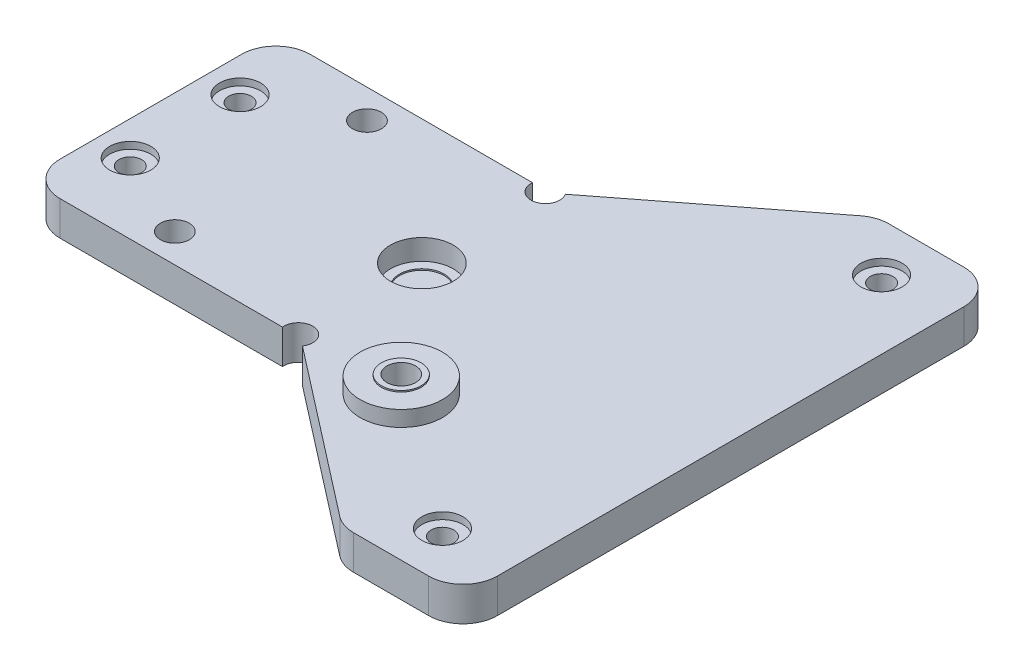
ISO-10303-21;
HEADER;
FILE_DESCRIPTION(('STEP AP214'),'2;1');
FILE_NAME('part.step','',(''),(''),'','','');
FILE_SCHEMA(('AUTOMOTIVE_DESIGN { 1 0 10303 214 1 1 1 1 }'));
ENDSEC;
DATA;
#1=APPLICATION_CONTEXT('core data for automotive mechanical design processes');
#2=APPLICATION_PROTOCOL_DEFINITION('international standard','automotive_design',2000,#1);
#3=PRODUCT_CONTEXT('',#1,'mechanical');
#4=PRODUCT('Part','Part','',(#3));
#5=PRODUCT_RELATED_PRODUCT_CATEGORY('part','',(#4));
#6=PRODUCT_DEFINITION_FORMATION('','',#4);
#7=PRODUCT_DEFINITION_CONTEXT('part definition',#1,'design');
#8=PRODUCT_DEFINITION('design','',#6,#7);
#9=PRODUCT_DEFINITION_SHAPE('','',#8);
#10=(LENGTH_UNIT() NAMED_UNIT(*) SI_UNIT(.MILLI.,.METRE.));
#11=(NAMED_UNIT(*) PLANE_ANGLE_UNIT() SI_UNIT($,.RADIAN.));
#12=(NAMED_UNIT(*) SI_UNIT($,.STERADIAN.) SOLID_ANGLE_UNIT());
#13=UNCERTAINTY_MEASURE_WITH_UNIT(LENGTH_MEASURE(1.E-05),#10,'distance_accuracy_value','');
#14=(GEOMETRIC_REPRESENTATION_CONTEXT(3) GLOBAL_UNCERTAINTY_ASSIGNED_CONTEXT((#13)) GLOBAL_UNIT_ASSIGNED_CONTEXT((#10,
#11,#12)) REPRESENTATION_CONTEXT('',''));
#15=CARTESIAN_POINT('',(0.,0.,0.));
#16=DIRECTION('',(0.,0.,1.));
#17=DIRECTION('',(1.,0.,0.));
#18=AXIS2_PLACEMENT_3D('',#15,#16,#17);
#19=CARTESIAN_POINT('',(-34.5,0.,-8.));
#20=DIRECTION('',(0.,1.,0.));
#21=DIRECTION('',(0.,0.,1.));
#22=AXIS2_PLACEMENT_3D('',#19,#20,#21);
#23=CYLINDRICAL_SURFACE('',#22,1.65);
#24=CARTESIAN_POINT('',(-34.5,0.,-8.));
#25=DIRECTION('',(0.,1.,0.));
#26=DIRECTION('',(0.,0.,1.));
#27=AXIS2_PLACEMENT_3D('',#24,#25,#26);
#28=CIRCLE('',#27,1.65);
#29=CARTESIAN_POINT('',(-34.5,0.,-6.35));
#30=VERTEX_POINT('',#29);
#31=EDGE_CURVE('E277',#30,#30,#28,.T.);
#32=ORIENTED_EDGE('',*,*,#31,.F.);
#33=EDGE_LOOP('',(#32));
#34=FACE_BOUND('',#33,.T.);
#35=CARTESIAN_POINT('',(-34.5,4.,-8.));
#36=DIRECTION('',(0.,1.,0.));
#37=DIRECTION('',(0.,0.,1.));
#38=AXIS2_PLACEMENT_3D('',#35,#36,#37);
#39=CIRCLE('',#38,1.65);
#40=CARTESIAN_POINT('',(-34.5,4.,-6.35));
#41=VERTEX_POINT('',#40);
#42=EDGE_CURVE('E109',#41,#41,#39,.F.);
#43=ORIENTED_EDGE('',*,*,#42,.F.);
#44=EDGE_LOOP('',(#43));
#45=FACE_BOUND('',#44,.T.);
#46=ADVANCED_FACE('F105',(#34,#45),#23,.F.);
#47=CARTESIAN_POINT('',(-34.5,0.,8.));
#48=DIRECTION('',(0.,1.,0.));
#49=DIRECTION('',(0.,0.,1.));
#50=AXIS2_PLACEMENT_3D('',#47,#48,#49);
#51=CYLINDRICAL_SURFACE('',#50,1.65);
#52=CARTESIAN_POINT('',(-34.5,0.,8.));
#53=DIRECTION('',(0.,1.,0.));
#54=DIRECTION('',(0.,0.,1.));
#55=AXIS2_PLACEMENT_3D('',#52,#53,#54);
#56=CIRCLE('',#55,1.65);
#57=CARTESIAN_POINT('',(-34.5,0.,9.65));
#58=VERTEX_POINT('',#57);
#59=EDGE_CURVE('E281',#58,#58,#56,.T.);
#60=ORIENTED_EDGE('',*,*,#59,.F.);
#61=EDGE_LOOP('',(#60));
#62=FACE_BOUND('',#61,.T.);
#63=CARTESIAN_POINT('',(-34.5,4.,8.));
#64=DIRECTION('',(0.,1.,0.));
#65=DIRECTION('',(0.,0.,1.));
#66=AXIS2_PLACEMENT_3D('',#63,#64,#65);
#67=CIRCLE('',#66,1.65);
#68=CARTESIAN_POINT('',(-34.5,4.,9.65));
#69=VERTEX_POINT('',#68);
#70=EDGE_CURVE('E377',#69,#69,#67,.F.);
#71=ORIENTED_EDGE('',*,*,#70,.F.);
#72=EDGE_LOOP('',(#71));
#73=FACE_BOUND('',#72,.T.);
#74=ADVANCED_FACE('F486',(#62,#73),#51,.F.);
#75=CARTESIAN_POINT('',(35.,0.,32.));
#76=DIRECTION('',(0.,1.,0.));
#77=DIRECTION('',(0.,0.,1.));
#78=AXIS2_PLACEMENT_3D('',#75,#76,#77);
#79=CYLINDRICAL_SURFACE('',#78,1.65);
#80=CARTESIAN_POINT('',(35.,0.,32.));
#81=DIRECTION('',(0.,1.,0.));
#82=DIRECTION('',(0.,0.,1.));
#83=AXIS2_PLACEMENT_3D('',#80,#81,#82);
#84=CIRCLE('',#83,1.65);
#85=CARTESIAN_POINT('',(35.,0.,33.65));
#86=VERTEX_POINT('',#85);
#87=EDGE_CURVE('E402',#86,#86,#84,.T.);
#88=ORIENTED_EDGE('',*,*,#87,.F.);
#89=EDGE_LOOP('',(#88));
#90=FACE_BOUND('',#89,.T.);
#91=CARTESIAN_POINT('',(35.,4.,32.));
#92=DIRECTION('',(0.,1.,0.));
#93=DIRECTION('',(0.,0.,1.));
#94=AXIS2_PLACEMENT_3D('',#91,#92,#93);
#95=CIRCLE('',#94,1.65);
#96=CARTESIAN_POINT('',(35.,4.,33.65));
#97=VERTEX_POINT('',#96);
#98=EDGE_CURVE('E374',#97,#97,#95,.F.);
#99=ORIENTED_EDGE('',*,*,#98,.F.);
#100=EDGE_LOOP('',(#99));
#101=FACE_BOUND('',#100,.T.);
#102=ADVANCED_FACE('F492',(#90,#101),#79,.F.);
#103=CARTESIAN_POINT('',(35.,0.,-32.));
#104=DIRECTION('',(0.,1.,0.));
#105=DIRECTION('',(0.,0.,1.));
#106=AXIS2_PLACEMENT_3D('',#103,#104,#105);
#107=CYLINDRICAL_SURFACE('',#106,1.65);
#108=CARTESIAN_POINT('',(35.,0.,-32.));
#109=DIRECTION('',(0.,1.,0.));
#110=DIRECTION('',(0.,0.,1.));
#111=AXIS2_PLACEMENT_3D('',#108,#109,#110);
#112=CIRCLE('',#111,1.65);
#113=CARTESIAN_POINT('',(35.,0.,-30.35));
#114=VERTEX_POINT('',#113);
#115=EDGE_CURVE('E403',#114,#114,#112,.T.);
#116=ORIENTED_EDGE('',*,*,#115,.F.);
#117=EDGE_LOOP('',(#116));
#118=FACE_BOUND('',#117,.T.);
#119=CARTESIAN_POINT('',(35.,4.,-32.));
#120=DIRECTION('',(0.,1.,0.));
#121=DIRECTION('',(0.,0.,1.));
#122=AXIS2_PLACEMENT_3D('',#119,#120,#121);
#123=CIRCLE('',#122,1.65);
#124=CARTESIAN_POINT('',(35.,4.,-30.35));
#125=VERTEX_POINT('',#124);
#126=EDGE_CURVE('E371',#125,#125,#123,.F.);
#127=ORIENTED_EDGE('',*,*,#126,.F.);
#128=EDGE_LOOP('',(#127));
#129=FACE_BOUND('',#128,.T.);
#130=ADVANCED_FACE('F563',(#118,#129),#107,.F.);
#131=CARTESIAN_POINT('',(15.,7.275,18.));
#132=DIRECTION('',(0.,1.,0.));
#133=DIRECTION('',(0.,0.,1.));
#134=AXIS2_PLACEMENT_3D('',#131,#132,#133);
#135=PLANE('',#134);
#136=CARTESIAN_POINT('',(15.,7.275,18.));
#137=DIRECTION('',(0.,1.,0.));
#138=DIRECTION('',(0.,0.,1.));
#139=AXIS2_PLACEMENT_3D('',#136,#137,#138);
#140=CIRCLE('',#139,6.);
#141=CARTESIAN_POINT('',(15.,7.275,24.));
#142=VERTEX_POINT('',#141);
#143=EDGE_CURVE('E398',#142,#142,#140,.T.);
#144=ORIENTED_EDGE('',*,*,#143,.T.);
#145=EDGE_LOOP('',(#144));
#146=FACE_BOUND('',#145,.T.);
#147=CARTESIAN_POINT('',(15.,7.275,18.));
#148=DIRECTION('',(0.,1.,0.));
#149=DIRECTION('',(0.,0.,1.));
#150=AXIS2_PLACEMENT_3D('',#147,#148,#149);
#151=CIRCLE('',#150,2.9);
#152=CARTESIAN_POINT('',(15.,7.275,20.9));
#153=VERTEX_POINT('',#152);
#154=EDGE_CURVE('E386',#153,#153,#151,.T.);
#155=ORIENTED_EDGE('',*,*,#154,.F.);
#156=EDGE_LOOP('',(#155));
#157=FACE_BOUND('',#156,.T.);
#158=ADVANCED_FACE('F531',(#146,#157),#135,.T.);
#159=CARTESIAN_POINT('',(0.,5.,0.));
#160=DIRECTION('',(0.,-1.,0.));
#161=DIRECTION('',(0.,0.,-1.));
#162=AXIS2_PLACEMENT_3D('',#159,#160,#161);
#163=PLANE('',#162);
#164=CARTESIAN_POINT('',(35.,5.,-32.));
#165=DIRECTION('',(0.,1.,0.));
#166=DIRECTION('',(0.,0.,1.));
#167=AXIS2_PLACEMENT_3D('',#164,#165,#166);
#168=CIRCLE('',#167,3.);
#169=CARTESIAN_POINT('',(35.,5.,-29.));
#170=VERTEX_POINT('',#169);
#171=EDGE_CURVE('E926',#170,#170,#168,.T.);
#172=ORIENTED_EDGE('',*,*,#171,.F.);
#173=EDGE_LOOP('',(#172));
#174=FACE_BOUND('',#173,.T.);
#175=CARTESIAN_POINT('',(35.,5.,32.));
#176=DIRECTION('',(0.,1.,0.));
#177=DIRECTION('',(0.,0.,1.));
#178=AXIS2_PLACEMENT_3D('',#175,#176,#177);
#179=CIRCLE('',#178,3.);
#180=CARTESIAN_POINT('',(35.,5.,35.));
#181=VERTEX_POINT('',#180);
#182=EDGE_CURVE('E918',#181,#181,#179,.T.);
#183=ORIENTED_EDGE('',*,*,#182,.F.);
#184=EDGE_LOOP('',(#183));
#185=FACE_BOUND('',#184,.T.);
#186=CARTESIAN_POINT('',(-34.5,5.,8.));
#187=DIRECTION('',(0.,1.,0.));
#188=DIRECTION('',(0.,0.,1.));
#189=AXIS2_PLACEMENT_3D('',#186,#187,#188);
#190=CIRCLE('',#189,3.);
#191=CARTESIAN_POINT('',(-34.5,5.,11.));
#192=VERTEX_POINT('',#191);
#193=EDGE_CURVE('E911',#192,#192,#190,.T.);
#194=ORIENTED_EDGE('',*,*,#193,.F.);
#195=EDGE_LOOP('',(#194));
#196=FACE_BOUND('',#195,.T.);
#197=CARTESIAN_POINT('',(-34.5,5.,-8.));
#198=DIRECTION('',(0.,1.,0.));
#199=DIRECTION('',(0.,0.,1.));
#200=AXIS2_PLACEMENT_3D('',#197,#198,#199);
#201=CIRCLE('',#200,3.);
#202=CARTESIAN_POINT('',(-34.5,5.,-5.));
#203=VERTEX_POINT('',#202);
#204=EDGE_CURVE('E395',#203,#203,#201,.T.);
#205=ORIENTED_EDGE('',*,*,#204,.F.);
#206=EDGE_LOOP('',(#205));
#207=FACE_BOUND('',#206,.T.);
#208=CARTESIAN_POINT('',(-22.,5.,14.));
#209=DIRECTION('',(0.,1.,0.));
#210=DIRECTION('',(0.,0.,1.));
#211=AXIS2_PLACEMENT_3D('',#208,#209,#210);
#212=CIRCLE('',#211,2.1);
#213=CARTESIAN_POINT('',(-22.,5.,16.1));
#214=VERTEX_POINT('',#213);
#215=EDGE_CURVE('E302',#214,#214,#212,.T.);
#216=ORIENTED_EDGE('',*,*,#215,.F.);
#217=EDGE_LOOP('',(#216));
#218=FACE_BOUND('',#217,.T.);
#219=DIRECTION('',(1.,0.,0.));
#220=VECTOR('',#219,1.);
#221=CARTESIAN_POINT('',(27.3422113683114,5.,38.9999999999999));
#222=LINE('',#221,#220);
#223=CARTESIAN_POINT('',(29.0537987356417,5.,38.9999999999999));
#224=VERTEX_POINT('',#223);
#225=CARTESIAN_POINT('',(40.,5.,38.9999999999999));
#226=VERTEX_POINT('',#225);
#227=EDGE_CURVE('E411',#224,#226,#222,.T.);
#228=ORIENTED_EDGE('',*,*,#227,.T.);
#229=CARTESIAN_POINT('',(40.,5.,33.9999999999999));
#230=DIRECTION('',(0.,-1.,0.));
#231=DIRECTION('',(0.,0.,-1.));
#232=AXIS2_PLACEMENT_3D('',#229,#230,#231);
#233=CIRCLE('',#232,5.);
#234=CARTESIAN_POINT('',(45.,5.,34.));
#235=VERTEX_POINT('',#234);
#236=EDGE_CURVE('E349',#226,#235,#233,.F.);
#237=ORIENTED_EDGE('',*,*,#236,.T.);
#238=DIRECTION('',(0.,0.,-1.));
#239=VECTOR('',#238,1.);
#240=CARTESIAN_POINT('',(45.,5.,-30.));
#241=LINE('',#240,#239);
#242=CARTESIAN_POINT('',(45.,5.,-34.0000000000001));
#243=VERTEX_POINT('',#242);
#244=EDGE_CURVE('E324',#235,#243,#241,.T.);
#245=ORIENTED_EDGE('',*,*,#244,.T.);
#246=CARTESIAN_POINT('',(40.,5.,-34.0000000000001));
#247=DIRECTION('',(0.,-1.,0.));
#248=DIRECTION('',(0.,0.,-1.));
#249=AXIS2_PLACEMENT_3D('',#246,#247,#248);
#250=CIRCLE('',#249,5.);
#251=CARTESIAN_POINT('',(40.,5.,-39.0000000000001));
#252=VERTEX_POINT('',#251);
#253=EDGE_CURVE('E343',#243,#252,#250,.F.);
#254=ORIENTED_EDGE('',*,*,#253,.T.);
#255=DIRECTION('',(-1.,0.,0.));
#256=VECTOR('',#255,1.);
#257=CARTESIAN_POINT('',(45.,5.,-39.0000000000001));
#258=LINE('',#257,#256);
#259=CARTESIAN_POINT('',(29.0537987356417,5.,-39.0000000000001));
#260=VERTEX_POINT('',#259);
#261=EDGE_CURVE('E414',#252,#260,#258,.T.);
#262=ORIENTED_EDGE('',*,*,#261,.T.);
#263=CARTESIAN_POINT('',(29.0537987356417,5.,-34.0000000000001));
#264=DIRECTION('',(0.,-1.,0.));
#265=DIRECTION('',(0.,0.,-1.));
#266=AXIS2_PLACEMENT_3D('',#263,#264,#265);
#267=CIRCLE('',#266,5.);
#268=CARTESIAN_POINT('',(25.9896811391723,5.,-37.9510990059738));
#269=VERTEX_POINT('',#268);
#270=EDGE_CURVE('E345',#260,#269,#267,.F.);
#271=ORIENTED_EDGE('',*,*,#270,.T.);
#272=DIRECTION('',(0.790219801194743,0.,-0.612823519293884));
#273=VECTOR('',#272,1.);
#274=CARTESIAN_POINT('',(0.548980681028139,5.,-18.2215762016987));
#275=LINE('',#274,#273);
#276=CARTESIAN_POINT('',(1.75342658030318,5.,-19.1556362868508));
#277=VERTEX_POINT('',#276);
#278=EDGE_CURVE('E257',#277,#269,#275,.T.);
#279=ORIENTED_EDGE('',*,*,#278,.F.);
#280=CARTESIAN_POINT('',(0.,5.,-18.));
#281=DIRECTION('',(0.,1.,0.));
#282=DIRECTION('',(0.,0.,1.));
#283=AXIS2_PLACEMENT_3D('',#280,#281,#282);
#284=CIRCLE('',#283,2.1);
#285=CARTESIAN_POINT('',(-2.08827775615237,5.,-18.2215762016987));
#286=VERTEX_POINT('',#285);
#287=EDGE_CURVE('E312',#286,#277,#284,.T.);
#288=ORIENTED_EDGE('',*,*,#287,.F.);
#289=DIRECTION('',(1.,0.,0.));
#290=VECTOR('',#289,1.);
#291=CARTESIAN_POINT('',(-22.,5.,-18.2215762016987));
#292=LINE('',#291,#290);
#293=CARTESIAN_POINT('',(-34.5,5.,-18.2215762016987));
#294=VERTEX_POINT('',#293);
#295=EDGE_CURVE('E272',#294,#286,#292,.T.);
#296=ORIENTED_EDGE('',*,*,#295,.F.);
#297=CARTESIAN_POINT('',(-34.5,5.,-13.2215762016987));
#298=DIRECTION('',(0.,-1.,0.));
#299=DIRECTION('',(0.,0.,1.));
#300=AXIS2_PLACEMENT_3D('',#297,#298,#299);
#301=CIRCLE('',#300,5.);
#302=CARTESIAN_POINT('',(-39.5,5.,-13.2215762016987));
#303=VERTEX_POINT('',#302);
#304=EDGE_CURVE('E269',#303,#294,#301,.T.);
#305=ORIENTED_EDGE('',*,*,#304,.F.);
#306=DIRECTION('',(0.,0.,-1.));
#307=VECTOR('',#306,1.);
#308=CARTESIAN_POINT('',(-39.5,5.,-13.2215762016987));
#309=LINE('',#308,#307);
#310=CARTESIAN_POINT('',(-39.5,5.,13.2215762016987));
#311=VERTEX_POINT('',#310);
#312=EDGE_CURVE('E266',#311,#303,#309,.T.);
#313=ORIENTED_EDGE('',*,*,#312,.F.);
#314=CARTESIAN_POINT('',(-34.5,5.,13.2215762016987));
#315=DIRECTION('',(0.,-1.,0.));
#316=DIRECTION('',(0.,0.,1.));
#317=AXIS2_PLACEMENT_3D('',#314,#315,#316);
#318=CIRCLE('',#317,5.);
#319=CARTESIAN_POINT('',(-34.5,5.,18.2215762016987));
#320=VERTEX_POINT('',#319);
#321=EDGE_CURVE('E264',#320,#311,#318,.T.);
#322=ORIENTED_EDGE('',*,*,#321,.F.);
#323=DIRECTION('',(-1.,0.,0.));
#324=VECTOR('',#323,1.);
#325=CARTESIAN_POINT('',(-34.5,5.,18.2215762016987));
#326=LINE('',#325,#324);
#327=CARTESIAN_POINT('',(-2.08827775615237,5.,18.2215762016987));
#328=VERTEX_POINT('',#327);
#329=EDGE_CURVE('E228',#328,#320,#326,.T.);
#330=ORIENTED_EDGE('',*,*,#329,.F.);
#331=CARTESIAN_POINT('',(0.,5.,18.));
#332=DIRECTION('',(0.,1.,0.));
#333=DIRECTION('',(0.,0.,1.));
#334=AXIS2_PLACEMENT_3D('',#331,#332,#333);
#335=CIRCLE('',#334,2.1);
#336=CARTESIAN_POINT('',(1.75342658030321,5.,19.1556362868508));
#337=VERTEX_POINT('',#336);
#338=EDGE_CURVE('E307',#337,#328,#335,.T.);
#339=ORIENTED_EDGE('',*,*,#338,.F.);
#340=DIRECTION('',(-0.790219801194744,0.,-0.612823519293882));
#341=VECTOR('',#340,1.);
#342=CARTESIAN_POINT('',(0.548980681028226,5.,18.2215762016987));
#343=LINE('',#342,#341);
#344=CARTESIAN_POINT('',(25.9896811391723,5.,37.9510990059737));
#345=VERTEX_POINT('',#344);
#346=EDGE_CURVE('E260',#345,#337,#343,.T.);
#347=ORIENTED_EDGE('',*,*,#346,.F.);
#348=CARTESIAN_POINT('',(29.0537987356417,5.,33.9999999999999));
#349=DIRECTION('',(0.,-1.,0.));
#350=DIRECTION('',(0.,0.,-1.));
#351=AXIS2_PLACEMENT_3D('',#348,#349,#350);
#352=CIRCLE('',#351,5.);
#353=EDGE_CURVE('E347',#345,#224,#352,.F.);
#354=ORIENTED_EDGE('',*,*,#353,.T.);
#355=EDGE_LOOP('',(#228,#237,#245,#254,#262,#271,#279,#288,#296,#305,#313,#322,#330,#339,#347,#354));
#356=FACE_BOUND('',#355,.T.);
#357=CARTESIAN_POINT('',(-22.,5.,-14.));
#358=DIRECTION('',(0.,1.,0.));
#359=DIRECTION('',(0.,0.,1.));
#360=AXIS2_PLACEMENT_3D('',#357,#358,#359);
#361=CIRCLE('',#360,2.1);
#362=CARTESIAN_POINT('',(-22.,5.,-11.9));
#363=VERTEX_POINT('',#362);
#364=EDGE_CURVE('E318',#363,#363,#361,.T.);
#365=ORIENTED_EDGE('',*,*,#364,.F.);
#366=EDGE_LOOP('',(#365));
#367=FACE_BOUND('',#366,.T.);
#368=CARTESIAN_POINT('',(0.,5.,0.));
#369=DIRECTION('',(0.,1.,0.));
#370=DIRECTION('',(0.,0.,1.));
#371=AXIS2_PLACEMENT_3D('',#368,#369,#370);
#372=CIRCLE('',#371,4.575);
#373=CARTESIAN_POINT('',(0.,5.,4.575));
#374=VERTEX_POINT('',#373);
#375=EDGE_CURVE('E290',#374,#374,#372,.T.);
#376=ORIENTED_EDGE('',*,*,#375,.F.);
#377=EDGE_LOOP('',(#376));
#378=FACE_BOUND('',#377,.T.);
#379=CARTESIAN_POINT('',(15.,5.,18.));
#380=DIRECTION('',(0.,-1.,0.));
#381=DIRECTION('',(0.,0.,-1.));
#382=AXIS2_PLACEMENT_3D('',#379,#380,#381);
#383=CIRCLE('',#382,6.);
#384=CARTESIAN_POINT('',(15.,5.,12.));
#385=VERTEX_POINT('',#384);
#386=EDGE_CURVE('E12',#385,#385,#383,.F.);
#387=ORIENTED_EDGE('',*,*,#386,.F.);
#388=EDGE_LOOP('',(#387));
#389=FACE_BOUND('',#388,.T.);
#390=ADVANCED_FACE('F431',(#174,#185,#196,#207,#218,#356,#367,#378,#389),#163,.F.);
#391=CARTESIAN_POINT('',(0.,0.,0.));
#392=DIRECTION('',(0.,-1.,0.));
#393=DIRECTION('',(0.,0.,-1.));
#394=AXIS2_PLACEMENT_3D('',#391,#392,#393);
#395=PLANE('',#394);
#396=ORIENTED_EDGE('',*,*,#115,.T.);
#397=EDGE_LOOP('',(#396));
#398=FACE_BOUND('',#397,.T.);
#399=ORIENTED_EDGE('',*,*,#87,.T.);
#400=EDGE_LOOP('',(#399));
#401=FACE_BOUND('',#400,.T.);
#402=DIRECTION('',(0.,0.,-1.));
#403=VECTOR('',#402,1.);
#404=CARTESIAN_POINT('',(45.,0.,-30.));
#405=LINE('',#404,#403);
#406=CARTESIAN_POINT('',(45.,0.,34.));
#407=VERTEX_POINT('',#406);
#408=CARTESIAN_POINT('',(45.,0.,-34.0000000000001));
#409=VERTEX_POINT('',#408);
#410=EDGE_CURVE('E321',#407,#409,#405,.T.);
#411=ORIENTED_EDGE('',*,*,#410,.F.);
#412=CARTESIAN_POINT('',(40.,0.,33.9999999999999));
#413=DIRECTION('',(0.,-1.,0.));
#414=DIRECTION('',(0.,0.,-1.));
#415=AXIS2_PLACEMENT_3D('',#412,#413,#414);
#416=CIRCLE('',#415,5.);
#417=CARTESIAN_POINT('',(40.,0.,38.9999999999999));
#418=VERTEX_POINT('',#417);
#419=EDGE_CURVE('E360',#407,#418,#416,.T.);
#420=ORIENTED_EDGE('',*,*,#419,.T.);
#421=DIRECTION('',(1.,0.,0.));
#422=VECTOR('',#421,1.);
#423=CARTESIAN_POINT('',(27.3422113683114,0.,38.9999999999999));
#424=LINE('',#423,#422);
#425=CARTESIAN_POINT('',(29.0537987356417,0.,38.9999999999999));
#426=VERTEX_POINT('',#425);
#427=EDGE_CURVE('E406',#426,#418,#424,.T.);
#428=ORIENTED_EDGE('',*,*,#427,.F.);
#429=CARTESIAN_POINT('',(29.0537987356417,0.,33.9999999999999));
#430=DIRECTION('',(0.,-1.,0.));
#431=DIRECTION('',(0.,0.,-1.));
#432=AXIS2_PLACEMENT_3D('',#429,#430,#431);
#433=CIRCLE('',#432,5.);
#434=CARTESIAN_POINT('',(25.9896811391723,0.,37.9510990059737));
#435=VERTEX_POINT('',#434);
#436=EDGE_CURVE('E122',#426,#435,#433,.T.);
#437=ORIENTED_EDGE('',*,*,#436,.T.);
#438=DIRECTION('',(-0.790219801194744,0.,-0.612823519293882));
#439=VECTOR('',#438,1.);
#440=CARTESIAN_POINT('',(0.548980681028226,0.,18.2215762016987));
#441=LINE('',#440,#439);
#442=CARTESIAN_POINT('',(1.75342658030321,0.,19.1556362868508));
#443=VERTEX_POINT('',#442);
#444=EDGE_CURVE('E248',#435,#443,#441,.T.);
#445=ORIENTED_EDGE('',*,*,#444,.T.);
#446=CARTESIAN_POINT('',(0.,0.,18.));
#447=DIRECTION('',(0.,1.,0.));
#448=DIRECTION('',(0.,0.,1.));
#449=AXIS2_PLACEMENT_3D('',#446,#447,#448);
#450=CIRCLE('',#449,2.1);
#451=CARTESIAN_POINT('',(-2.08827775615237,0.,18.2215762016987));
#452=VERTEX_POINT('',#451);
#453=EDGE_CURVE('E247',#443,#452,#450,.T.);
#454=ORIENTED_EDGE('',*,*,#453,.T.);
#455=DIRECTION('',(-1.,0.,0.));
#456=VECTOR('',#455,1.);
#457=CARTESIAN_POINT('',(-8.29751994050381,0.,18.2215762016987));
#458=LINE('',#457,#456);
#459=CARTESIAN_POINT('',(-34.5,0.,18.2215762016987));
#460=VERTEX_POINT('',#459);
#461=EDGE_CURVE('E225',#452,#460,#458,.T.);
#462=ORIENTED_EDGE('',*,*,#461,.T.);
#463=CARTESIAN_POINT('',(-34.5,0.,13.2215762016987));
#464=DIRECTION('',(0.,-1.,0.));
#465=DIRECTION('',(0.,0.,1.));
#466=AXIS2_PLACEMENT_3D('',#463,#464,#465);
#467=CIRCLE('',#466,5.);
#468=CARTESIAN_POINT('',(-39.5,0.,13.2215762016987));
#469=VERTEX_POINT('',#468);
#470=EDGE_CURVE('E236',#460,#469,#467,.T.);
#471=ORIENTED_EDGE('',*,*,#470,.T.);
#472=DIRECTION('',(0.,0.,-1.));
#473=VECTOR('',#472,1.);
#474=CARTESIAN_POINT('',(-39.5,0.,-13.2215762016987));
#475=LINE('',#474,#473);
#476=CARTESIAN_POINT('',(-39.5,0.,-13.2215762016987));
#477=VERTEX_POINT('',#476);
#478=EDGE_CURVE('E240',#469,#477,#475,.T.);
#479=ORIENTED_EDGE('',*,*,#478,.T.);
#480=CARTESIAN_POINT('',(-34.5,0.,-13.2215762016987));
#481=DIRECTION('',(0.,-1.,0.));
#482=DIRECTION('',(0.,0.,1.));
#483=AXIS2_PLACEMENT_3D('',#480,#481,#482);
#484=CIRCLE('',#483,5.);
#485=CARTESIAN_POINT('',(-34.5,0.,-18.2215762016987));
#486=VERTEX_POINT('',#485);
#487=EDGE_CURVE('E233',#477,#486,#484,.T.);
#488=ORIENTED_EDGE('',*,*,#487,.T.);
#489=DIRECTION('',(1.,0.,0.));
#490=VECTOR('',#489,1.);
#491=CARTESIAN_POINT('',(-22.,0.,-18.2215762016987));
#492=LINE('',#491,#490);
#493=CARTESIAN_POINT('',(-2.08827775615237,0.,-18.2215762016987));
#494=VERTEX_POINT('',#493);
#495=EDGE_CURVE('E274',#486,#494,#492,.T.);
#496=ORIENTED_EDGE('',*,*,#495,.T.);
#497=CARTESIAN_POINT('',(0.,0.,-18.));
#498=DIRECTION('',(0.,1.,0.));
#499=DIRECTION('',(0.,0.,1.));
#500=AXIS2_PLACEMENT_3D('',#497,#498,#499);
#501=CIRCLE('',#500,2.1);
#502=CARTESIAN_POINT('',(1.75342658030318,0.,-19.1556362868508));
#503=VERTEX_POINT('',#502);
#504=EDGE_CURVE('E310',#494,#503,#501,.T.);
#505=ORIENTED_EDGE('',*,*,#504,.T.);
#506=DIRECTION('',(0.790219801194743,0.,-0.612823519293884));
#507=VECTOR('',#506,1.);
#508=CARTESIAN_POINT('',(0.548980681028139,0.,-18.2215762016987));
#509=LINE('',#508,#507);
#510=CARTESIAN_POINT('',(25.9896811391723,0.,-37.9510990059738));
#511=VERTEX_POINT('',#510);
#512=EDGE_CURVE('E250',#503,#511,#509,.T.);
#513=ORIENTED_EDGE('',*,*,#512,.T.);
#514=CARTESIAN_POINT('',(29.0537987356417,0.,-34.0000000000001));
#515=DIRECTION('',(0.,-1.,0.));
#516=DIRECTION('',(0.,0.,-1.));
#517=AXIS2_PLACEMENT_3D('',#514,#515,#516);
#518=CIRCLE('',#517,5.);
#519=CARTESIAN_POINT('',(29.0537987356417,0.,-39.0000000000001));
#520=VERTEX_POINT('',#519);
#521=EDGE_CURVE('E129',#511,#520,#518,.T.);
#522=ORIENTED_EDGE('',*,*,#521,.T.);
#523=DIRECTION('',(-1.,0.,0.));
#524=VECTOR('',#523,1.);
#525=CARTESIAN_POINT('',(45.,0.,-39.0000000000001));
#526=LINE('',#525,#524);
#527=CARTESIAN_POINT('',(40.,0.,-39.0000000000001));
#528=VERTEX_POINT('',#527);
#529=EDGE_CURVE('E261',#528,#520,#526,.T.);
#530=ORIENTED_EDGE('',*,*,#529,.F.);
#531=CARTESIAN_POINT('',(40.,0.,-34.0000000000001));
#532=DIRECTION('',(0.,-1.,0.));
#533=DIRECTION('',(0.,0.,-1.));
#534=AXIS2_PLACEMENT_3D('',#531,#532,#533);
#535=CIRCLE('',#534,5.);
#536=EDGE_CURVE('E356',#528,#409,#535,.T.);
#537=ORIENTED_EDGE('',*,*,#536,.T.);
#538=EDGE_LOOP('',(#411,#420,#428,#437,#445,#454,#462,#471,#479,#488,#496,#505,#513,#522,#530,#537));
#539=FACE_BOUND('',#538,.T.);
#540=ORIENTED_EDGE('',*,*,#59,.T.);
#541=EDGE_LOOP('',(#540));
#542=FACE_BOUND('',#541,.T.);
#543=ORIENTED_EDGE('',*,*,#31,.T.);
#544=EDGE_LOOP('',(#543));
#545=FACE_BOUND('',#544,.T.);
#546=CARTESIAN_POINT('',(-22.,0.,14.));
#547=DIRECTION('',(0.,1.,0.));
#548=DIRECTION('',(0.,0.,1.));
#549=AXIS2_PLACEMENT_3D('',#546,#547,#548);
#550=CIRCLE('',#549,2.1);
#551=CARTESIAN_POINT('',(-22.,0.,16.1));
#552=VERTEX_POINT('',#551);
#553=EDGE_CURVE('E301',#552,#552,#550,.T.);
#554=ORIENTED_EDGE('',*,*,#553,.T.);
#555=EDGE_LOOP('',(#554));
#556=FACE_BOUND('',#555,.T.);
#557=CARTESIAN_POINT('',(-22.,0.,-14.));
#558=DIRECTION('',(0.,1.,0.));
#559=DIRECTION('',(0.,0.,1.));
#560=AXIS2_PLACEMENT_3D('',#557,#558,#559);
#561=CIRCLE('',#560,2.1);
#562=CARTESIAN_POINT('',(-22.,0.,-11.9));
#563=VERTEX_POINT('',#562);
#564=EDGE_CURVE('E315',#563,#563,#561,.T.);
#565=ORIENTED_EDGE('',*,*,#564,.T.);
#566=EDGE_LOOP('',(#565));
#567=FACE_BOUND('',#566,.T.);
#568=CARTESIAN_POINT('',(15.,0.,18.));
#569=DIRECTION('',(0.,1.,0.));
#570=DIRECTION('',(0.,0.,1.));
#571=AXIS2_PLACEMENT_3D('',#568,#569,#570);
#572=CIRCLE('',#571,2.1);
#573=CARTESIAN_POINT('',(15.,0.,20.1));
#574=VERTEX_POINT('',#573);
#575=EDGE_CURVE('E296',#574,#574,#572,.T.);
#576=ORIENTED_EDGE('',*,*,#575,.T.);
#577=EDGE_LOOP('',(#576));
#578=FACE_BOUND('',#577,.T.);
#579=ADVANCED_FACE('F244',(#398,#401,#539,#542,#545,#556,#567,#578),#395,.T.);
#580=CARTESIAN_POINT('',(45.,5.,-30.));
#581=DIRECTION('',(-1.,0.,0.));
#582=DIRECTION('',(0.,0.,1.));
#583=AXIS2_PLACEMENT_3D('',#580,#581,#582);
#584=PLANE('',#583);
#585=ORIENTED_EDGE('',*,*,#244,.F.);
#586=DIRECTION('',(0.,1.,0.));
#587=VECTOR('',#586,1.);
#588=CARTESIAN_POINT('',(45.,0.,33.9999999999999));
#589=LINE('',#588,#587);
#590=EDGE_CURVE('E354',#235,#407,#589,.F.);
#591=ORIENTED_EDGE('',*,*,#590,.T.);
#592=ORIENTED_EDGE('',*,*,#410,.T.);
#593=DIRECTION('',(0.,1.,0.));
#594=VECTOR('',#593,1.);
#595=CARTESIAN_POINT('',(45.,5.,-34.0000000000001));
#596=LINE('',#595,#594);
#597=EDGE_CURVE('E351',#409,#243,#596,.T.);
#598=ORIENTED_EDGE('',*,*,#597,.T.);
#599=EDGE_LOOP('',(#585,#591,#592,#598));
#600=FACE_BOUND('',#599,.T.);
#601=ADVANCED_FACE('F439',(#600),#584,.F.);
#602=CARTESIAN_POINT('',(-22.,5.,-14.));
#603=DIRECTION('',(0.,-1.,0.));
#604=DIRECTION('',(0.,0.,-1.));
#605=AXIS2_PLACEMENT_3D('',#602,#603,#604);
#606=CYLINDRICAL_SURFACE('',#605,2.1);
#607=ORIENTED_EDGE('',*,*,#364,.T.);
#608=EDGE_LOOP('',(#607));
#609=FACE_BOUND('',#608,.T.);
#610=ORIENTED_EDGE('',*,*,#564,.F.);
#611=EDGE_LOOP('',(#610));
#612=FACE_BOUND('',#611,.T.);
#613=ADVANCED_FACE('F525',(#609,#612),#606,.F.);
#614=CARTESIAN_POINT('',(0.,5.,-18.));
#615=DIRECTION('',(0.,-1.,0.));
#616=DIRECTION('',(0.,0.,-1.));
#617=AXIS2_PLACEMENT_3D('',#614,#615,#616);
#618=CYLINDRICAL_SURFACE('',#617,2.1);
#619=DIRECTION('',(0.,-1.,0.));
#620=VECTOR('',#619,1.);
#621=CARTESIAN_POINT('',(-2.08827775615237,5.,-18.2215762016987));
#622=LINE('',#621,#620);
#623=EDGE_CURVE('E336',#286,#494,#622,.T.);
#624=ORIENTED_EDGE('',*,*,#623,.F.);
#625=ORIENTED_EDGE('',*,*,#287,.T.);
#626=DIRECTION('',(0.,-1.,0.));
#627=VECTOR('',#626,1.);
#628=CARTESIAN_POINT('',(1.75342658030318,5.,-19.1556362868508));
#629=LINE('',#628,#627);
#630=EDGE_CURVE('E334',#503,#277,#629,.F.);
#631=ORIENTED_EDGE('',*,*,#630,.F.);
#632=ORIENTED_EDGE('',*,*,#504,.F.);
#633=EDGE_LOOP('',(#624,#625,#631,#632));
#634=FACE_BOUND('',#633,.T.);
#635=ADVANCED_FACE('F473',(#634),#618,.F.);
#636=CARTESIAN_POINT('',(0.,5.,18.));
#637=DIRECTION('',(0.,-1.,0.));
#638=DIRECTION('',(0.,0.,-1.));
#639=AXIS2_PLACEMENT_3D('',#636,#637,#638);
#640=CYLINDRICAL_SURFACE('',#639,2.1);
#641=DIRECTION('',(0.,-1.,0.));
#642=VECTOR('',#641,1.);
#643=CARTESIAN_POINT('',(-2.08827775615237,5.,18.2215762016987));
#644=LINE('',#643,#642);
#645=EDGE_CURVE('E332',#452,#328,#644,.F.);
#646=ORIENTED_EDGE('',*,*,#645,.F.);
#647=ORIENTED_EDGE('',*,*,#453,.F.);
#648=DIRECTION('',(0.,-1.,0.));
#649=VECTOR('',#648,1.);
#650=CARTESIAN_POINT('',(1.75342658030321,5.,19.1556362868508));
#651=LINE('',#650,#649);
#652=EDGE_CURVE('E327',#337,#443,#651,.T.);
#653=ORIENTED_EDGE('',*,*,#652,.F.);
#654=ORIENTED_EDGE('',*,*,#338,.T.);
#655=EDGE_LOOP('',(#646,#647,#653,#654));
#656=FACE_BOUND('',#655,.T.);
#657=ADVANCED_FACE('F458',(#656),#640,.F.);
#658=CARTESIAN_POINT('',(-22.,5.,14.));
#659=DIRECTION('',(0.,-1.,0.));
#660=DIRECTION('',(0.,0.,-1.));
#661=AXIS2_PLACEMENT_3D('',#658,#659,#660);
#662=CYLINDRICAL_SURFACE('',#661,2.1);
#663=ORIENTED_EDGE('',*,*,#215,.T.);
#664=EDGE_LOOP('',(#663));
#665=FACE_BOUND('',#664,.T.);
#666=ORIENTED_EDGE('',*,*,#553,.F.);
#667=EDGE_LOOP('',(#666));
#668=FACE_BOUND('',#667,.T.);
#669=ADVANCED_FACE('F516',(#665,#668),#662,.F.);
#670=CARTESIAN_POINT('',(15.,5.,18.));
#671=DIRECTION('',(0.,-1.,0.));
#672=DIRECTION('',(0.,0.,-1.));
#673=AXIS2_PLACEMENT_3D('',#670,#671,#672);
#674=CYLINDRICAL_SURFACE('',#673,2.1);
#675=ORIENTED_EDGE('',*,*,#575,.F.);
#676=EDGE_LOOP('',(#675));
#677=FACE_BOUND('',#676,.T.);
#678=CARTESIAN_POINT('',(15.,7.475,18.));
#679=DIRECTION('',(0.,1.,0.));
#680=DIRECTION('',(0.,0.,1.));
#681=AXIS2_PLACEMENT_3D('',#678,#679,#680);
#682=CIRCLE('',#681,2.1);
#683=CARTESIAN_POINT('',(15.,7.475,20.1));
#684=VERTEX_POINT('',#683);
#685=EDGE_CURVE('E382',#684,#684,#682,.T.);
#686=ORIENTED_EDGE('',*,*,#685,.T.);
#687=EDGE_LOOP('',(#686));
#688=FACE_BOUND('',#687,.T.);
#689=ADVANCED_FACE('F512',(#677,#688),#674,.F.);
#690=CARTESIAN_POINT('',(0.,2.,0.));
#691=DIRECTION('',(0.,1.,0.));
#692=DIRECTION('',(0.,0.,1.));
#693=AXIS2_PLACEMENT_3D('',#690,#691,#692);
#694=CYLINDRICAL_SURFACE('',#693,4.575);
#695=CARTESIAN_POINT('',(0.,2.,0.));
#696=DIRECTION('',(0.,1.,0.));
#697=DIRECTION('',(0.,0.,1.));
#698=AXIS2_PLACEMENT_3D('',#695,#696,#697);
#699=CIRCLE('',#698,4.575);
#700=CARTESIAN_POINT('',(0.,2.,4.575));
#701=VERTEX_POINT('',#700);
#702=EDGE_CURVE('E293',#701,#701,#699,.T.);
#703=ORIENTED_EDGE('',*,*,#702,.F.);
#704=EDGE_LOOP('',(#703));
#705=FACE_BOUND('',#704,.T.);
#706=ORIENTED_EDGE('',*,*,#375,.T.);
#707=EDGE_LOOP('',(#706));
#708=FACE_BOUND('',#707,.T.);
#709=ADVANCED_FACE('F508',(#705,#708),#694,.F.);
#710=CARTESIAN_POINT('',(0.,2.,0.));
#711=DIRECTION('',(0.,1.,0.));
#712=DIRECTION('',(0.,0.,1.));
#713=AXIS2_PLACEMENT_3D('',#710,#711,#712);
#714=PLANE('',#713);
#715=CARTESIAN_POINT('',(0.,2.,0.));
#716=DIRECTION('',(0.,1.,0.));
#717=DIRECTION('',(0.,0.,1.));
#718=AXIS2_PLACEMENT_3D('',#715,#716,#717);
#719=CIRCLE('',#718,3.25);
#720=CARTESIAN_POINT('',(0.,2.,3.25));
#721=VERTEX_POINT('',#720);
#722=EDGE_CURVE('E284',#721,#721,#719,.T.);
#723=ORIENTED_EDGE('',*,*,#722,.F.);
#724=EDGE_LOOP('',(#723));
#725=FACE_BOUND('',#724,.T.);
#726=ORIENTED_EDGE('',*,*,#702,.T.);
#727=EDGE_LOOP('',(#726));
#728=FACE_BOUND('',#727,.T.);
#729=ADVANCED_FACE('F504',(#725,#728),#714,.T.);
#730=CARTESIAN_POINT('',(0.,1.8,0.));
#731=DIRECTION('',(0.,1.,0.));
#732=DIRECTION('',(0.,0.,1.));
#733=AXIS2_PLACEMENT_3D('',#730,#731,#732);
#734=CYLINDRICAL_SURFACE('',#733,3.25);
#735=CARTESIAN_POINT('',(0.,1.8,0.));
#736=DIRECTION('',(0.,1.,0.));
#737=DIRECTION('',(0.,0.,1.));
#738=AXIS2_PLACEMENT_3D('',#735,#736,#737);
#739=CIRCLE('',#738,3.25);
#740=CARTESIAN_POINT('',(0.,1.8,3.25));
#741=VERTEX_POINT('',#740);
#742=EDGE_CURVE('E287',#741,#741,#739,.T.);
#743=ORIENTED_EDGE('',*,*,#742,.F.);
#744=EDGE_LOOP('',(#743));
#745=FACE_BOUND('',#744,.T.);
#746=ORIENTED_EDGE('',*,*,#722,.T.);
#747=EDGE_LOOP('',(#746));
#748=FACE_BOUND('',#747,.T.);
#749=ADVANCED_FACE('F500',(#745,#748),#734,.F.);
#750=CARTESIAN_POINT('',(0.,1.8,0.));
#751=DIRECTION('',(0.,1.,0.));
#752=DIRECTION('',(0.,0.,1.));
#753=AXIS2_PLACEMENT_3D('',#750,#751,#752);
#754=PLANE('',#753);
#755=ORIENTED_EDGE('',*,*,#742,.T.);
#756=EDGE_LOOP('',(#755));
#757=FACE_BOUND('',#756,.T.);
#758=ADVANCED_FACE('F497',(#757),#754,.T.);
#759=CARTESIAN_POINT('',(0.548980681028226,0.,18.2215762016987));
#760=DIRECTION('',(0.612823519293882,0.,-0.790219801194744));
#761=DIRECTION('',(-0.790219801194744,0.,-0.612823519293882));
#762=AXIS2_PLACEMENT_3D('',#759,#760,#761);
#763=PLANE('',#762);
#764=ORIENTED_EDGE('',*,*,#444,.F.);
#765=DIRECTION('',(0.,1.,0.));
#766=VECTOR('',#765,1.);
#767=CARTESIAN_POINT('',(25.9896811391723,5.,37.9510990059737));
#768=LINE('',#767,#766);
#769=EDGE_CURVE('E362',#435,#345,#768,.T.);
#770=ORIENTED_EDGE('',*,*,#769,.T.);
#771=ORIENTED_EDGE('',*,*,#346,.T.);
#772=ORIENTED_EDGE('',*,*,#652,.T.);
#773=EDGE_LOOP('',(#764,#770,#771,#772));
#774=FACE_BOUND('',#773,.T.);
#775=ADVANCED_FACE('F455',(#774),#763,.F.);
#776=CARTESIAN_POINT('',(-22.,0.,-18.2215762016987));
#777=DIRECTION('',(0.,0.,1.));
#778=DIRECTION('',(1.,0.,0.));
#779=AXIS2_PLACEMENT_3D('',#776,#777,#778);
#780=PLANE('',#779);
#781=ORIENTED_EDGE('',*,*,#623,.T.);
#782=ORIENTED_EDGE('',*,*,#495,.F.);
#783=DIRECTION('',(0.,1.,0.));
#784=VECTOR('',#783,1.);
#785=CARTESIAN_POINT('',(-34.5,0.,-18.2215762016987));
#786=LINE('',#785,#784);
#787=EDGE_CURVE('E275',#486,#294,#786,.T.);
#788=ORIENTED_EDGE('',*,*,#787,.T.);
#789=ORIENTED_EDGE('',*,*,#295,.T.);
#790=EDGE_LOOP('',(#781,#782,#788,#789));
#791=FACE_BOUND('',#790,.T.);
#792=ADVANCED_FACE('F469',(#791),#780,.F.);
#793=CARTESIAN_POINT('',(-34.5,0.,18.2215762016987));
#794=DIRECTION('',(0.,0.,-1.));
#795=DIRECTION('',(-1.,0.,0.));
#796=AXIS2_PLACEMENT_3D('',#793,#794,#795);
#797=PLANE('',#796);
#798=ORIENTED_EDGE('',*,*,#645,.T.);
#799=ORIENTED_EDGE('',*,*,#329,.T.);
#800=DIRECTION('',(0.,1.,0.));
#801=VECTOR('',#800,1.);
#802=CARTESIAN_POINT('',(-34.5,0.,18.2215762016987));
#803=LINE('',#802,#801);
#804=EDGE_CURVE('E221',#460,#320,#803,.T.);
#805=ORIENTED_EDGE('',*,*,#804,.F.);
#806=ORIENTED_EDGE('',*,*,#461,.F.);
#807=EDGE_LOOP('',(#798,#799,#805,#806));
#808=FACE_BOUND('',#807,.T.);
#809=ADVANCED_FACE('F223',(#808),#797,.F.);
#810=CARTESIAN_POINT('',(-34.5,0.,13.2215762016987));
#811=DIRECTION('',(0.,1.,0.));
#812=DIRECTION('',(0.,0.,1.));
#813=AXIS2_PLACEMENT_3D('',#810,#811,#812);
#814=CYLINDRICAL_SURFACE('',#813,5.);
#815=ORIENTED_EDGE('',*,*,#321,.T.);
#816=DIRECTION('',(0.,1.,0.));
#817=VECTOR('',#816,1.);
#818=CARTESIAN_POINT('',(-39.5,0.,13.2215762016987));
#819=LINE('',#818,#817);
#820=EDGE_CURVE('E232',#469,#311,#819,.T.);
#821=ORIENTED_EDGE('',*,*,#820,.F.);
#822=ORIENTED_EDGE('',*,*,#470,.F.);
#823=ORIENTED_EDGE('',*,*,#804,.T.);
#824=EDGE_LOOP('',(#815,#821,#822,#823));
#825=FACE_BOUND('',#824,.T.);
#826=ADVANCED_FACE('F237',(#825),#814,.T.);
#827=CARTESIAN_POINT('',(-39.5,0.,-13.2215762016987));
#828=DIRECTION('',(1.,0.,0.));
#829=DIRECTION('',(0.,0.,-1.));
#830=AXIS2_PLACEMENT_3D('',#827,#828,#829);
#831=PLANE('',#830);
#832=ORIENTED_EDGE('',*,*,#312,.T.);
#833=DIRECTION('',(0.,1.,0.));
#834=VECTOR('',#833,1.);
#835=CARTESIAN_POINT('',(-39.5,0.,-13.2215762016987));
#836=LINE('',#835,#834);
#837=EDGE_CURVE('E278',#477,#303,#836,.T.);
#838=ORIENTED_EDGE('',*,*,#837,.F.);
#839=ORIENTED_EDGE('',*,*,#478,.F.);
#840=ORIENTED_EDGE('',*,*,#820,.T.);
#841=EDGE_LOOP('',(#832,#838,#839,#840));
#842=FACE_BOUND('',#841,.T.);
#843=ADVANCED_FACE('F463',(#842),#831,.F.);
#844=CARTESIAN_POINT('',(-34.5,0.,-13.2215762016987));
#845=DIRECTION('',(0.,1.,0.));
#846=DIRECTION('',(0.,0.,1.));
#847=AXIS2_PLACEMENT_3D('',#844,#845,#846);
#848=CYLINDRICAL_SURFACE('',#847,5.);
#849=ORIENTED_EDGE('',*,*,#304,.T.);
#850=ORIENTED_EDGE('',*,*,#787,.F.);
#851=ORIENTED_EDGE('',*,*,#487,.F.);
#852=ORIENTED_EDGE('',*,*,#837,.T.);
#853=EDGE_LOOP('',(#849,#850,#851,#852));
#854=FACE_BOUND('',#853,.T.);
#855=ADVANCED_FACE('F467',(#854),#848,.T.);
#856=CARTESIAN_POINT('',(0.548980681028139,0.,-18.2215762016987));
#857=DIRECTION('',(0.612823519293884,0.,0.790219801194743));
#858=DIRECTION('',(0.790219801194743,0.,-0.612823519293884));
#859=AXIS2_PLACEMENT_3D('',#856,#857,#858);
#860=PLANE('',#859);
#861=ORIENTED_EDGE('',*,*,#278,.T.);
#862=DIRECTION('',(0.,1.,0.));
#863=VECTOR('',#862,1.);
#864=CARTESIAN_POINT('',(25.9896811391722,0.,-37.9510990059738));
#865=LINE('',#864,#863);
#866=EDGE_CURVE('E114',#269,#511,#865,.F.);
#867=ORIENTED_EDGE('',*,*,#866,.T.);
#868=ORIENTED_EDGE('',*,*,#512,.F.);
#869=ORIENTED_EDGE('',*,*,#630,.T.);
#870=EDGE_LOOP('',(#861,#867,#868,#869));
#871=FACE_BOUND('',#870,.T.);
#872=ADVANCED_FACE('F474',(#871),#860,.F.);
#873=CARTESIAN_POINT('',(45.,-30.6157835117745,-39.0000000000001));
#874=DIRECTION('',(0.,0.,-1.));
#875=DIRECTION('',(-1.,0.,0.));
#876=AXIS2_PLACEMENT_3D('',#873,#874,#875);
#877=PLANE('',#876);
#878=ORIENTED_EDGE('',*,*,#529,.T.);
#879=DIRECTION('',(0.,1.,0.));
#880=VECTOR('',#879,1.);
#881=CARTESIAN_POINT('',(29.0537987356417,5.,-39.0000000000001));
#882=LINE('',#881,#880);
#883=EDGE_CURVE('E367',#520,#260,#882,.T.);
#884=ORIENTED_EDGE('',*,*,#883,.T.);
#885=ORIENTED_EDGE('',*,*,#261,.F.);
#886=DIRECTION('',(0.,1.,0.));
#887=VECTOR('',#886,1.);
#888=CARTESIAN_POINT('',(40.,0.,-39.0000000000001));
#889=LINE('',#888,#887);
#890=EDGE_CURVE('E365',#252,#528,#889,.F.);
#891=ORIENTED_EDGE('',*,*,#890,.T.);
#892=EDGE_LOOP('',(#878,#884,#885,#891));
#893=FACE_BOUND('',#892,.T.);
#894=ADVANCED_FACE('F428',(#893),#877,.T.);
#895=CARTESIAN_POINT('',(27.3422113683114,-30.6157835117745,38.9999999999999));
#896=DIRECTION('',(0.,0.,1.));
#897=DIRECTION('',(1.,0.,0.));
#898=AXIS2_PLACEMENT_3D('',#895,#896,#897);
#899=PLANE('',#898);
#900=ORIENTED_EDGE('',*,*,#427,.T.);
#901=DIRECTION('',(0.,1.,0.));
#902=VECTOR('',#901,1.);
#903=CARTESIAN_POINT('',(40.,5.,38.9999999999999));
#904=LINE('',#903,#902);
#905=EDGE_CURVE('E340',#418,#226,#904,.T.);
#906=ORIENTED_EDGE('',*,*,#905,.T.);
#907=ORIENTED_EDGE('',*,*,#227,.F.);
#908=DIRECTION('',(0.,1.,0.));
#909=VECTOR('',#908,1.);
#910=CARTESIAN_POINT('',(29.0537987356417,0.,38.9999999999999));
#911=LINE('',#910,#909);
#912=EDGE_CURVE('E338',#224,#426,#911,.F.);
#913=ORIENTED_EDGE('',*,*,#912,.T.);
#914=EDGE_LOOP('',(#900,#906,#907,#913));
#915=FACE_BOUND('',#914,.T.);
#916=ADVANCED_FACE('F447',(#915),#899,.T.);
#917=CARTESIAN_POINT('',(40.,-30.6157835117745,33.9999999999999));
#918=DIRECTION('',(0.,-1.,0.));
#919=DIRECTION('',(0.,0.,-1.));
#920=AXIS2_PLACEMENT_3D('',#917,#918,#919);
#921=CYLINDRICAL_SURFACE('',#920,5.);
#922=ORIENTED_EDGE('',*,*,#419,.F.);
#923=ORIENTED_EDGE('',*,*,#590,.F.);
#924=ORIENTED_EDGE('',*,*,#236,.F.);
#925=ORIENTED_EDGE('',*,*,#905,.F.);
#926=EDGE_LOOP('',(#922,#923,#924,#925));
#927=FACE_BOUND('',#926,.T.);
#928=ADVANCED_FACE('F444',(#927),#921,.T.);
#929=CARTESIAN_POINT('',(29.0537987356417,0.,33.9999999999999));
#930=DIRECTION('',(0.,-1.,0.));
#931=DIRECTION('',(0.,0.,-1.));
#932=AXIS2_PLACEMENT_3D('',#929,#930,#931);
#933=CYLINDRICAL_SURFACE('',#932,5.);
#934=ORIENTED_EDGE('',*,*,#436,.F.);
#935=ORIENTED_EDGE('',*,*,#912,.F.);
#936=ORIENTED_EDGE('',*,*,#353,.F.);
#937=ORIENTED_EDGE('',*,*,#769,.F.);
#938=EDGE_LOOP('',(#934,#935,#936,#937));
#939=FACE_BOUND('',#938,.T.);
#940=ADVANCED_FACE('F453',(#939),#933,.T.);
#941=CARTESIAN_POINT('',(29.0537987356417,-30.6157835117745,-34.0000000000001));
#942=DIRECTION('',(0.,-1.,0.));
#943=DIRECTION('',(0.,0.,-1.));
#944=AXIS2_PLACEMENT_3D('',#941,#942,#943);
#945=CYLINDRICAL_SURFACE('',#944,5.);
#946=ORIENTED_EDGE('',*,*,#521,.F.);
#947=ORIENTED_EDGE('',*,*,#866,.F.);
#948=ORIENTED_EDGE('',*,*,#270,.F.);
#949=ORIENTED_EDGE('',*,*,#883,.F.);
#950=EDGE_LOOP('',(#946,#947,#948,#949));
#951=FACE_BOUND('',#950,.T.);
#952=ADVANCED_FACE('F425',(#951),#945,.T.);
#953=CARTESIAN_POINT('',(40.,5.,-34.0000000000001));
#954=DIRECTION('',(0.,-1.,0.));
#955=DIRECTION('',(0.,0.,-1.));
#956=AXIS2_PLACEMENT_3D('',#953,#954,#955);
#957=CYLINDRICAL_SURFACE('',#956,5.);
#958=ORIENTED_EDGE('',*,*,#536,.F.);
#959=ORIENTED_EDGE('',*,*,#890,.F.);
#960=ORIENTED_EDGE('',*,*,#253,.F.);
#961=ORIENTED_EDGE('',*,*,#597,.F.);
#962=EDGE_LOOP('',(#958,#959,#960,#961));
#963=FACE_BOUND('',#962,.T.);
#964=ADVANCED_FACE('F107',(#963),#957,.T.);
#965=CARTESIAN_POINT('',(15.,7.275,18.));
#966=DIRECTION('',(0.,-1.,0.));
#967=DIRECTION('',(0.,0.,-1.));
#968=AXIS2_PLACEMENT_3D('',#965,#966,#967);
#969=CYLINDRICAL_SURFACE('',#968,6.);
#970=ORIENTED_EDGE('',*,*,#143,.F.);
#971=EDGE_LOOP('',(#970));
#972=FACE_BOUND('',#971,.T.);
#973=ORIENTED_EDGE('',*,*,#386,.T.);
#974=EDGE_LOOP('',(#973));
#975=FACE_BOUND('',#974,.T.);
#976=ADVANCED_FACE('F545',(#972,#975),#969,.T.);
#977=CARTESIAN_POINT('',(15.,7.475,18.));
#978=DIRECTION('',(0.,1.,0.));
#979=DIRECTION('',(0.,0.,1.));
#980=AXIS2_PLACEMENT_3D('',#977,#978,#979);
#981=PLANE('',#980);
#982=CARTESIAN_POINT('',(15.,7.475,18.));
#983=DIRECTION('',(0.,1.,0.));
#984=DIRECTION('',(0.,0.,1.));
#985=AXIS2_PLACEMENT_3D('',#982,#983,#984);
#986=CIRCLE('',#985,2.9);
#987=CARTESIAN_POINT('',(15.,7.475,20.9));
#988=VERTEX_POINT('',#987);
#989=EDGE_CURVE('E391',#988,#988,#986,.T.);
#990=ORIENTED_EDGE('',*,*,#989,.T.);
#991=EDGE_LOOP('',(#990));
#992=FACE_BOUND('',#991,.T.);
#993=ORIENTED_EDGE('',*,*,#685,.F.);
#994=EDGE_LOOP('',(#993));
#995=FACE_BOUND('',#994,.T.);
#996=ADVANCED_FACE('F549',(#992,#995),#981,.T.);
#997=CARTESIAN_POINT('',(15.,7.475,18.));
#998=DIRECTION('',(0.,-1.,0.));
#999=DIRECTION('',(0.,0.,-1.));
#1000=AXIS2_PLACEMENT_3D('',#997,#998,#999);
#1001=CYLINDRICAL_SURFACE('',#1000,2.9);
#1002=ORIENTED_EDGE('',*,*,#989,.F.);
#1003=EDGE_LOOP('',(#1002));
#1004=FACE_BOUND('',#1003,.T.);
#1005=ORIENTED_EDGE('',*,*,#154,.T.);
#1006=EDGE_LOOP('',(#1005));
#1007=FACE_BOUND('',#1006,.T.);
#1008=ADVANCED_FACE('F555',(#1004,#1007),#1001,.T.);
#1009=CARTESIAN_POINT('',(35.,4.,-32.));
#1010=DIRECTION('',(0.,1.,0.));
#1011=DIRECTION('',(0.,0.,1.));
#1012=AXIS2_PLACEMENT_3D('',#1009,#1010,#1011);
#1013=PLANE('',#1012);
#1014=CARTESIAN_POINT('',(35.,4.,-32.));
#1015=DIRECTION('',(0.,1.,0.));
#1016=DIRECTION('',(0.,0.,1.));
#1017=AXIS2_PLACEMENT_3D('',#1014,#1015,#1016);
#1018=CIRCLE('',#1017,3.);
#1019=CARTESIAN_POINT('',(35.,4.,-29.));
#1020=VERTEX_POINT('',#1019);
#1021=EDGE_CURVE('E929',#1020,#1020,#1018,.T.);
#1022=ORIENTED_EDGE('',*,*,#1021,.T.);
#1023=EDGE_LOOP('',(#1022));
#1024=FACE_BOUND('',#1023,.T.);
#1025=ORIENTED_EDGE('',*,*,#126,.T.);
#1026=EDGE_LOOP('',(#1025));
#1027=FACE_BOUND('',#1026,.T.);
#1028=ADVANCED_FACE('F777',(#1024,#1027),#1013,.T.);
#1029=CARTESIAN_POINT('',(35.,4.,-32.));
#1030=DIRECTION('',(0.,1.,0.));
#1031=DIRECTION('',(0.,0.,1.));
#1032=AXIS2_PLACEMENT_3D('',#1029,#1030,#1031);
#1033=CYLINDRICAL_SURFACE('',#1032,3.);
#1034=ORIENTED_EDGE('',*,*,#1021,.F.);
#1035=EDGE_LOOP('',(#1034));
#1036=FACE_BOUND('',#1035,.T.);
#1037=ORIENTED_EDGE('',*,*,#171,.T.);
#1038=EDGE_LOOP('',(#1037));
#1039=FACE_BOUND('',#1038,.T.);
#1040=ADVANCED_FACE('F812',(#1036,#1039),#1033,.F.);
#1041=CARTESIAN_POINT('',(35.,4.,32.));
#1042=DIRECTION('',(0.,1.,0.));
#1043=DIRECTION('',(0.,0.,1.));
#1044=AXIS2_PLACEMENT_3D('',#1041,#1042,#1043);
#1045=PLANE('',#1044);
#1046=CARTESIAN_POINT('',(35.,4.,32.));
#1047=DIRECTION('',(0.,1.,0.));
#1048=DIRECTION('',(0.,0.,1.));
#1049=AXIS2_PLACEMENT_3D('',#1046,#1047,#1048);
#1050=CIRCLE('',#1049,3.);
#1051=CARTESIAN_POINT('',(35.,4.,35.));
#1052=VERTEX_POINT('',#1051);
#1053=EDGE_CURVE('E923',#1052,#1052,#1050,.T.);
#1054=ORIENTED_EDGE('',*,*,#1053,.T.);
#1055=EDGE_LOOP('',(#1054));
#1056=FACE_BOUND('',#1055,.T.);
#1057=ORIENTED_EDGE('',*,*,#98,.T.);
#1058=EDGE_LOOP('',(#1057));
#1059=FACE_BOUND('',#1058,.T.);
#1060=ADVANCED_FACE('F821',(#1056,#1059),#1045,.T.);
#1061=CARTESIAN_POINT('',(35.,4.,32.));
#1062=DIRECTION('',(0.,1.,0.));
#1063=DIRECTION('',(0.,0.,1.));
#1064=AXIS2_PLACEMENT_3D('',#1061,#1062,#1063);
#1065=CYLINDRICAL_SURFACE('',#1064,3.);
#1066=ORIENTED_EDGE('',*,*,#1053,.F.);
#1067=EDGE_LOOP('',(#1066));
#1068=FACE_BOUND('',#1067,.T.);
#1069=ORIENTED_EDGE('',*,*,#182,.T.);
#1070=EDGE_LOOP('',(#1069));
#1071=FACE_BOUND('',#1070,.T.);
#1072=ADVANCED_FACE('F831',(#1068,#1071),#1065,.F.);
#1073=CARTESIAN_POINT('',(-34.5,4.,8.));
#1074=DIRECTION('',(0.,1.,0.));
#1075=DIRECTION('',(0.,0.,1.));
#1076=AXIS2_PLACEMENT_3D('',#1073,#1074,#1075);
#1077=PLANE('',#1076);
#1078=CARTESIAN_POINT('',(-34.5,4.,8.));
#1079=DIRECTION('',(0.,1.,0.));
#1080=DIRECTION('',(0.,0.,1.));
#1081=AXIS2_PLACEMENT_3D('',#1078,#1079,#1080);
#1082=CIRCLE('',#1081,3.);
#1083=CARTESIAN_POINT('',(-34.5,4.,11.));
#1084=VERTEX_POINT('',#1083);
#1085=EDGE_CURVE('E913',#1084,#1084,#1082,.T.);
#1086=ORIENTED_EDGE('',*,*,#1085,.T.);
#1087=EDGE_LOOP('',(#1086));
#1088=FACE_BOUND('',#1087,.T.);
#1089=ORIENTED_EDGE('',*,*,#70,.T.);
#1090=EDGE_LOOP('',(#1089));
#1091=FACE_BOUND('',#1090,.T.);
#1092=ADVANCED_FACE('F841',(#1088,#1091),#1077,.T.);
#1093=CARTESIAN_POINT('',(-34.5,4.,8.));
#1094=DIRECTION('',(0.,1.,0.));
#1095=DIRECTION('',(0.,0.,1.));
#1096=AXIS2_PLACEMENT_3D('',#1093,#1094,#1095);
#1097=CYLINDRICAL_SURFACE('',#1096,3.);
#1098=ORIENTED_EDGE('',*,*,#1085,.F.);
#1099=EDGE_LOOP('',(#1098));
#1100=FACE_BOUND('',#1099,.T.);
#1101=ORIENTED_EDGE('',*,*,#193,.T.);
#1102=EDGE_LOOP('',(#1101));
#1103=FACE_BOUND('',#1102,.T.);
#1104=ADVANCED_FACE('F851',(#1100,#1103),#1097,.F.);
#1105=CARTESIAN_POINT('',(-34.5,4.,-8.));
#1106=DIRECTION('',(0.,1.,0.));
#1107=DIRECTION('',(0.,0.,1.));
#1108=AXIS2_PLACEMENT_3D('',#1105,#1106,#1107);
#1109=PLANE('',#1108);
#1110=CARTESIAN_POINT('',(-34.5,4.,-8.));
#1111=DIRECTION('',(0.,1.,0.));
#1112=DIRECTION('',(0.,0.,1.));
#1113=AXIS2_PLACEMENT_3D('',#1110,#1111,#1112);
#1114=CIRCLE('',#1113,3.);
#1115=CARTESIAN_POINT('',(-34.5,4.,-5.));
#1116=VERTEX_POINT('',#1115);
#1117=EDGE_CURVE('E375',#1116,#1116,#1114,.T.);
#1118=ORIENTED_EDGE('',*,*,#1117,.T.);
#1119=EDGE_LOOP('',(#1118));
#1120=FACE_BOUND('',#1119,.T.);
#1121=ORIENTED_EDGE('',*,*,#42,.T.);
#1122=EDGE_LOOP('',(#1121));
#1123=FACE_BOUND('',#1122,.T.);
#1124=ADVANCED_FACE('F861',(#1120,#1123),#1109,.T.);
#1125=CARTESIAN_POINT('',(-34.5,4.,-8.));
#1126=DIRECTION('',(0.,1.,0.));
#1127=DIRECTION('',(0.,0.,1.));
#1128=AXIS2_PLACEMENT_3D('',#1125,#1126,#1127);
#1129=CYLINDRICAL_SURFACE('',#1128,3.);
#1130=ORIENTED_EDGE('',*,*,#1117,.F.);
#1131=EDGE_LOOP('',(#1130));
#1132=FACE_BOUND('',#1131,.T.);
#1133=ORIENTED_EDGE('',*,*,#204,.T.);
#1134=EDGE_LOOP('',(#1133));
#1135=FACE_BOUND('',#1134,.T.);
#1136=ADVANCED_FACE('F871',(#1132,#1135),#1129,.F.);
#1137=CLOSED_SHELL('',(#46,#74,#102,#130,#158,#390,#579,#601,#613,#635,#657,#669,#689,#709,#729,
#749,#758,#775,#792,#809,#826,#843,#855,#872,#894,#916,#928,#940,#952,#964,#976,#996,#1008,
#1028,#1040,#1060,#1072,#1092,#1104,#1124,#1136));
#1138=MANIFOLD_SOLID_BREP('B2',#1137);
#1139=ADVANCED_BREP_SHAPE_REPRESENTATION('',(#18,#1138),#14);
#1140=SHAPE_DEFINITION_REPRESENTATION(#9,#1139);
ENDSEC;
END-ISO-10303-21;
